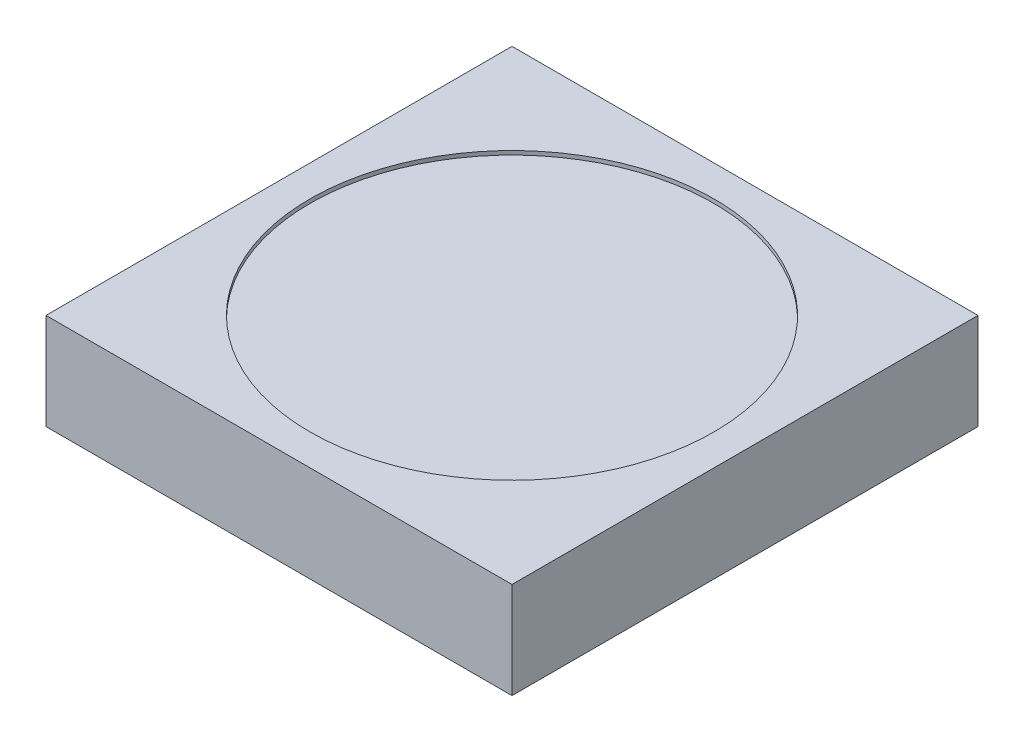
ISO-10303-21;
HEADER;
FILE_DESCRIPTION(('STEP AP214'),'2;1');
FILE_NAME('part.step','',(''),(''),'','','');
FILE_SCHEMA(('AUTOMOTIVE_DESIGN { 1 0 10303 214 1 1 1 1 }'));
ENDSEC;
DATA;
#1=APPLICATION_CONTEXT('core data for automotive mechanical design processes');
#2=APPLICATION_PROTOCOL_DEFINITION('international standard','automotive_design',2000,#1);
#3=PRODUCT_CONTEXT('',#1,'mechanical');
#4=PRODUCT('Part','Part','',(#3));
#5=PRODUCT_RELATED_PRODUCT_CATEGORY('part','',(#4));
#6=PRODUCT_DEFINITION_FORMATION('','',#4);
#7=PRODUCT_DEFINITION_CONTEXT('part definition',#1,'design');
#8=PRODUCT_DEFINITION('design','',#6,#7);
#9=PRODUCT_DEFINITION_SHAPE('','',#8);
#10=(LENGTH_UNIT() NAMED_UNIT(*) SI_UNIT(.MILLI.,.METRE.));
#11=(NAMED_UNIT(*) PLANE_ANGLE_UNIT() SI_UNIT($,.RADIAN.));
#12=(NAMED_UNIT(*) SI_UNIT($,.STERADIAN.) SOLID_ANGLE_UNIT());
#13=UNCERTAINTY_MEASURE_WITH_UNIT(LENGTH_MEASURE(1.E-05),#10,'distance_accuracy_value','');
#14=(GEOMETRIC_REPRESENTATION_CONTEXT(3) GLOBAL_UNCERTAINTY_ASSIGNED_CONTEXT((#13)) GLOBAL_UNIT_ASSIGNED_CONTEXT((#10,
#11,#12)) REPRESENTATION_CONTEXT('',''));
#15=CARTESIAN_POINT('',(0.,0.,0.));
#16=DIRECTION('',(0.,0.,1.));
#17=DIRECTION('',(1.,0.,0.));
#18=AXIS2_PLACEMENT_3D('',#15,#16,#17);
#19=CARTESIAN_POINT('',(-7.62,0.5946,0.));
#20=DIRECTION('',(0.,1.,0.));
#21=DIRECTION('',(0.,0.,1.));
#22=AXIS2_PLACEMENT_3D('',#19,#20,#21);
#23=PLANE('',#22);
#24=CARTESIAN_POINT('',(-7.62,0.5946,0.));
#25=DIRECTION('',(0.,1.,0.));
#26=DIRECTION('',(0.,0.,1.));
#27=AXIS2_PLACEMENT_3D('',#24,#25,#26);
#28=CIRCLE('',#27,1.3);
#29=CARTESIAN_POINT('',(-7.62,0.5946,1.3));
#30=VERTEX_POINT('',#29);
#31=EDGE_CURVE('E19',#30,#30,#28,.T.);
#32=ORIENTED_EDGE('',*,*,#31,.T.);
#33=EDGE_LOOP('',(#32));
#34=FACE_BOUND('',#33,.T.);
#35=ADVANCED_FACE('F16',(#34),#23,.T.);
#36=CARTESIAN_POINT('',(-7.62,0.5946,0.));
#37=DIRECTION('',(0.,1.,0.));
#38=DIRECTION('',(0.,0.,1.));
#39=AXIS2_PLACEMENT_3D('',#36,#37,#38);
#40=CYLINDRICAL_SURFACE('',#39,1.3);
#41=ORIENTED_EDGE('',*,*,#31,.F.);
#42=EDGE_LOOP('',(#41));
#43=FACE_BOUND('',#42,.T.);
#44=CARTESIAN_POINT('',(-7.62,0.62,0.));
#45=DIRECTION('',(0.,1.,0.));
#46=DIRECTION('',(0.,0.,1.));
#47=AXIS2_PLACEMENT_3D('',#44,#45,#46);
#48=CIRCLE('',#47,1.3);
#49=CARTESIAN_POINT('',(-7.62,0.62,1.3));
#50=VERTEX_POINT('',#49);
#51=EDGE_CURVE('E73',#50,#50,#48,.T.);
#52=ORIENTED_EDGE('',*,*,#51,.T.);
#53=EDGE_LOOP('',(#52));
#54=FACE_BOUND('',#53,.T.);
#55=ADVANCED_FACE('F90',(#43,#54),#40,.F.);
#56=CARTESIAN_POINT('',(0.,0.62,0.));
#57=DIRECTION('',(0.,-1.,0.));
#58=DIRECTION('',(0.,0.,-1.));
#59=AXIS2_PLACEMENT_3D('',#56,#57,#58);
#60=PLANE('',#59);
#61=DIRECTION('',(1.,0.,0.));
#62=VECTOR('',#61,1.);
#63=CARTESIAN_POINT('',(-9.12,0.62,-1.5));
#64=LINE('',#63,#62);
#65=CARTESIAN_POINT('',(-6.12,0.62,-1.5));
#66=VERTEX_POINT('',#65);
#67=CARTESIAN_POINT('',(-9.12,0.62,-1.5));
#68=VERTEX_POINT('',#67);
#69=EDGE_CURVE('E201',#66,#68,#64,.F.);
#70=ORIENTED_EDGE('',*,*,#69,.T.);
#71=DIRECTION('',(0.,0.,-1.));
#72=VECTOR('',#71,1.);
#73=CARTESIAN_POINT('',(-9.12,0.62,1.5));
#74=LINE('',#73,#72);
#75=CARTESIAN_POINT('',(-9.12,0.62,1.5));
#76=VERTEX_POINT('',#75);
#77=EDGE_CURVE('E54',#68,#76,#74,.F.);
#78=ORIENTED_EDGE('',*,*,#77,.T.);
#79=DIRECTION('',(-1.,0.,0.));
#80=VECTOR('',#79,1.);
#81=CARTESIAN_POINT('',(-9.12,0.62,1.5));
#82=LINE('',#81,#80);
#83=CARTESIAN_POINT('',(-6.12,0.62,1.5));
#84=VERTEX_POINT('',#83);
#85=EDGE_CURVE('E56',#76,#84,#82,.F.);
#86=ORIENTED_EDGE('',*,*,#85,.T.);
#87=DIRECTION('',(0.,0.,1.));
#88=VECTOR('',#87,1.);
#89=CARTESIAN_POINT('',(-6.12,0.62,1.5));
#90=LINE('',#89,#88);
#91=EDGE_CURVE('E60',#84,#66,#90,.F.);
#92=ORIENTED_EDGE('',*,*,#91,.T.);
#93=EDGE_LOOP('',(#70,#78,#86,#92));
#94=FACE_BOUND('',#93,.T.);
#95=ORIENTED_EDGE('',*,*,#51,.F.);
#96=EDGE_LOOP('',(#95));
#97=FACE_BOUND('',#96,.T.);
#98=ADVANCED_FACE('F58',(#94,#97),#60,.F.);
#99=CARTESIAN_POINT('',(-6.12,0.62,1.5));
#100=DIRECTION('',(-1.,0.,0.));
#101=DIRECTION('',(0.,0.,1.));
#102=AXIS2_PLACEMENT_3D('',#99,#100,#101);
#103=PLANE('',#102);
#104=DIRECTION('',(0.,1.,0.));
#105=VECTOR('',#104,1.);
#106=CARTESIAN_POINT('',(-6.12,0.62,-1.5));
#107=LINE('',#106,#105);
#108=CARTESIAN_POINT('',(-6.12,0.,-1.5));
#109=VERTEX_POINT('',#108);
#110=EDGE_CURVE('E71',#109,#66,#107,.T.);
#111=ORIENTED_EDGE('',*,*,#110,.T.);
#112=ORIENTED_EDGE('',*,*,#91,.F.);
#113=DIRECTION('',(0.,1.,0.));
#114=VECTOR('',#113,1.);
#115=CARTESIAN_POINT('',(-6.12,0.62,1.5));
#116=LINE('',#115,#114);
#117=CARTESIAN_POINT('',(-6.12,0.,1.5));
#118=VERTEX_POINT('',#117);
#119=EDGE_CURVE('E65',#84,#118,#116,.F.);
#120=ORIENTED_EDGE('',*,*,#119,.T.);
#121=DIRECTION('',(0.,0.,-1.));
#122=VECTOR('',#121,1.);
#123=CARTESIAN_POINT('',(-6.12,0.,0.));
#124=LINE('',#123,#122);
#125=EDGE_CURVE('E206',#109,#118,#124,.F.);
#126=ORIENTED_EDGE('',*,*,#125,.F.);
#127=EDGE_LOOP('',(#111,#112,#120,#126));
#128=FACE_BOUND('',#127,.T.);
#129=ADVANCED_FACE('F68',(#128),#103,.F.);
#130=CARTESIAN_POINT('',(-9.12,0.62,1.5));
#131=DIRECTION('',(0.,0.,-1.));
#132=DIRECTION('',(-1.,0.,0.));
#133=AXIS2_PLACEMENT_3D('',#130,#131,#132);
#134=PLANE('',#133);
#135=ORIENTED_EDGE('',*,*,#119,.F.);
#136=ORIENTED_EDGE('',*,*,#85,.F.);
#137=DIRECTION('',(0.,1.,0.));
#138=VECTOR('',#137,1.);
#139=CARTESIAN_POINT('',(-9.12,0.62,1.5));
#140=LINE('',#139,#138);
#141=CARTESIAN_POINT('',(-9.12,0.,1.5));
#142=VERTEX_POINT('',#141);
#143=EDGE_CURVE('E80',#76,#142,#140,.F.);
#144=ORIENTED_EDGE('',*,*,#143,.T.);
#145=DIRECTION('',(1.,0.,0.));
#146=VECTOR('',#145,1.);
#147=CARTESIAN_POINT('',(0.,0.,1.5));
#148=LINE('',#147,#146);
#149=EDGE_CURVE('E77',#118,#142,#148,.F.);
#150=ORIENTED_EDGE('',*,*,#149,.F.);
#151=EDGE_LOOP('',(#135,#136,#144,#150));
#152=FACE_BOUND('',#151,.T.);
#153=ADVANCED_FACE('F75',(#152),#134,.F.);
#154=CARTESIAN_POINT('',(-9.12,0.62,1.5));
#155=DIRECTION('',(1.,0.,0.));
#156=DIRECTION('',(0.,0.,-1.));
#157=AXIS2_PLACEMENT_3D('',#154,#155,#156);
#158=PLANE('',#157);
#159=ORIENTED_EDGE('',*,*,#143,.F.);
#160=ORIENTED_EDGE('',*,*,#77,.F.);
#161=DIRECTION('',(0.,1.,0.));
#162=VECTOR('',#161,1.);
#163=CARTESIAN_POINT('',(-9.12,0.62,-1.5));
#164=LINE('',#163,#162);
#165=CARTESIAN_POINT('',(-9.12,0.,-1.5));
#166=VERTEX_POINT('',#165);
#167=EDGE_CURVE('E34',#68,#166,#164,.F.);
#168=ORIENTED_EDGE('',*,*,#167,.T.);
#169=DIRECTION('',(0.,0.,-1.));
#170=VECTOR('',#169,1.);
#171=CARTESIAN_POINT('',(-9.12,0.,0.));
#172=LINE('',#171,#170);
#173=EDGE_CURVE('E25',#142,#166,#172,.T.);
#174=ORIENTED_EDGE('',*,*,#173,.F.);
#175=EDGE_LOOP('',(#159,#160,#168,#174));
#176=FACE_BOUND('',#175,.T.);
#177=ADVANCED_FACE('F106',(#176),#158,.F.);
#178=CARTESIAN_POINT('',(-9.12,0.62,-1.5));
#179=DIRECTION('',(0.,0.,1.));
#180=DIRECTION('',(1.,0.,0.));
#181=AXIS2_PLACEMENT_3D('',#178,#179,#180);
#182=PLANE('',#181);
#183=ORIENTED_EDGE('',*,*,#167,.F.);
#184=ORIENTED_EDGE('',*,*,#69,.F.);
#185=ORIENTED_EDGE('',*,*,#110,.F.);
#186=DIRECTION('',(1.,0.,0.));
#187=VECTOR('',#186,1.);
#188=CARTESIAN_POINT('',(0.,0.,-1.5));
#189=LINE('',#188,#187);
#190=EDGE_CURVE('E10',#166,#109,#189,.T.);
#191=ORIENTED_EDGE('',*,*,#190,.F.);
#192=EDGE_LOOP('',(#183,#184,#185,#191));
#193=FACE_BOUND('',#192,.T.);
#194=ADVANCED_FACE('F100',(#193),#182,.F.);
#195=CARTESIAN_POINT('',(0.,0.,0.));
#196=DIRECTION('',(0.,-1.,0.));
#197=DIRECTION('',(0.,0.,-1.));
#198=AXIS2_PLACEMENT_3D('',#195,#196,#197);
#199=PLANE('',#198);
#200=ORIENTED_EDGE('',*,*,#173,.T.);
#201=ORIENTED_EDGE('',*,*,#190,.T.);
#202=ORIENTED_EDGE('',*,*,#125,.T.);
#203=ORIENTED_EDGE('',*,*,#149,.T.);
#204=EDGE_LOOP('',(#200,#201,#202,#203));
#205=FACE_BOUND('',#204,.T.);
#206=ADVANCED_FACE('F98',(#205),#199,.T.);
#207=CLOSED_SHELL('',(#35,#55,#98,#129,#153,#177,#194,#206));
#208=MANIFOLD_SOLID_BREP('B1',#207);
#209=ADVANCED_BREP_SHAPE_REPRESENTATION('',(#18,#208),#14);
#210=SHAPE_DEFINITION_REPRESENTATION(#9,#209);
ENDSEC;
END-ISO-10303-21;
